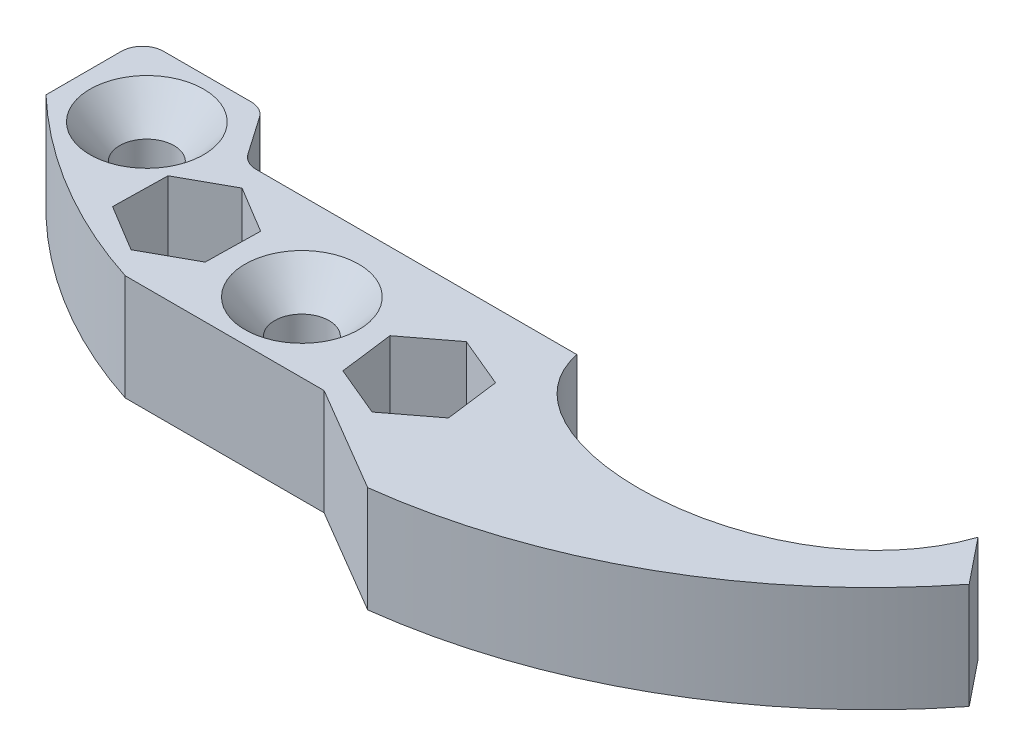
ISO-10303-21;
HEADER;
FILE_DESCRIPTION(('STEP AP214'),'2;1');
FILE_NAME('part.step','',(''),(''),'','','');
FILE_SCHEMA(('AUTOMOTIVE_DESIGN { 1 0 10303 214 1 1 1 1 }'));
ENDSEC;
DATA;
#1=APPLICATION_CONTEXT('core data for automotive mechanical design processes');
#2=APPLICATION_PROTOCOL_DEFINITION('international standard','automotive_design',2000,#1);
#3=PRODUCT_CONTEXT('',#1,'mechanical');
#4=PRODUCT('Part','Part','',(#3));
#5=PRODUCT_RELATED_PRODUCT_CATEGORY('part','',(#4));
#6=PRODUCT_DEFINITION_FORMATION('','',#4);
#7=PRODUCT_DEFINITION_CONTEXT('part definition',#1,'design');
#8=PRODUCT_DEFINITION('design','',#6,#7);
#9=PRODUCT_DEFINITION_SHAPE('','',#8);
#10=(LENGTH_UNIT() NAMED_UNIT(*) SI_UNIT(.MILLI.,.METRE.));
#11=(NAMED_UNIT(*) PLANE_ANGLE_UNIT() SI_UNIT($,.RADIAN.));
#12=(NAMED_UNIT(*) SI_UNIT($,.STERADIAN.) SOLID_ANGLE_UNIT());
#13=UNCERTAINTY_MEASURE_WITH_UNIT(LENGTH_MEASURE(1.E-05),#10,'distance_accuracy_value','');
#14=(GEOMETRIC_REPRESENTATION_CONTEXT(3) GLOBAL_UNCERTAINTY_ASSIGNED_CONTEXT((#13)) GLOBAL_UNIT_ASSIGNED_CONTEXT((#10,
#11,#12)) REPRESENTATION_CONTEXT('',''));
#15=CARTESIAN_POINT('',(0.,0.,0.));
#16=DIRECTION('',(0.,0.,1.));
#17=DIRECTION('',(1.,0.,0.));
#18=AXIS2_PLACEMENT_3D('',#15,#16,#17);
#19=CARTESIAN_POINT('',(-8.87325336655043,12.7,-2.54000000000001));
#20=DIRECTION('',(0.,-1.,0.));
#21=DIRECTION('',(0.,0.,-1.));
#22=AXIS2_PLACEMENT_3D('',#19,#20,#21);
#23=PLANE('',#22);
#24=DIRECTION('',(-0.127031471207743,0.,-0.991898687025442));
#25=VECTOR('',#24,1.);
#26=CARTESIAN_POINT('',(28.4717942533014,12.7,14.2888551399786));
#27=LINE('',#26,#25);
#28=CARTESIAN_POINT('',(28.4717942533015,12.7,14.2888551399786));
#29=VERTEX_POINT('',#28);
#30=CARTESIAN_POINT('',(27.6418820980321,12.7,7.80865956850573));
#31=VERTEX_POINT('',#30);
#32=EDGE_CURVE('E233',#29,#31,#27,.T.);
#33=ORIENTED_EDGE('',*,*,#32,.F.);
#34=DIRECTION('',(0.795493725340591,0.,-0.605961824658739));
#35=VECTOR('',#34,1.);
#36=CARTESIAN_POINT('',(23.2747363445492,12.7,18.2476779350877));
#37=LINE('',#36,#35);
#38=CARTESIAN_POINT('',(23.2747363445492,12.7,18.2476779350877));
#39=VERTEX_POINT('',#38);
#40=EDGE_CURVE('E48',#39,#29,#37,.T.);
#41=ORIENTED_EDGE('',*,*,#40,.F.);
#42=DIRECTION('',(0.922525196548335,0.,0.385936862366704));
#43=VECTOR('',#42,1.);
#44=CARTESIAN_POINT('',(17.2477662805276,12.7,15.726305158724));
#45=LINE('',#44,#43);
#46=CARTESIAN_POINT('',(17.2477662805276,12.7,15.726305158724));
#47=VERTEX_POINT('',#46);
#48=EDGE_CURVE('E219',#47,#39,#45,.T.);
#49=ORIENTED_EDGE('',*,*,#48,.F.);
#50=DIRECTION('',(0.127031471207743,0.,0.991898687025442));
#51=VECTOR('',#50,1.);
#52=CARTESIAN_POINT('',(16.4178541252583,12.7,9.2461095872512));
#53=LINE('',#52,#51);
#54=CARTESIAN_POINT('',(16.4178541252583,12.7,9.2461095872512));
#55=VERTEX_POINT('',#54);
#56=EDGE_CURVE('E222',#55,#47,#53,.T.);
#57=ORIENTED_EDGE('',*,*,#56,.F.);
#58=DIRECTION('',(-0.795493725340592,0.,0.605961824658738));
#59=VECTOR('',#58,1.);
#60=CARTESIAN_POINT('',(21.6149120340106,12.7,5.28728679214204));
#61=LINE('',#60,#59);
#62=CARTESIAN_POINT('',(21.6149120340106,12.7,5.28728679214204));
#63=VERTEX_POINT('',#62);
#64=EDGE_CURVE('E238',#63,#55,#61,.T.);
#65=ORIENTED_EDGE('',*,*,#64,.F.);
#66=DIRECTION('',(-0.922525196548335,0.,-0.385936862366704));
#67=VECTOR('',#66,1.);
#68=CARTESIAN_POINT('',(27.6418820980321,12.7,7.80865956850573));
#69=LINE('',#68,#67);
#70=EDGE_CURVE('E235',#31,#63,#69,.T.);
#71=ORIENTED_EDGE('',*,*,#70,.F.);
#72=EDGE_LOOP('',(#33,#41,#49,#57,#65,#71));
#73=FACE_BOUND('',#72,.T.);
#74=DIRECTION('',(-0.856714069287169,0.,-0.515791627971431));
#75=VECTOR('',#74,1.);
#76=CARTESIAN_POINT('',(-2.19158464827311,12.7,6.15485008911938));
#77=LINE('',#76,#75);
#78=CARTESIAN_POINT('',(-2.19158464827311,12.7,6.15485008911938));
#79=VERTEX_POINT('',#78);
#80=CARTESIAN_POINT('',(-7.7886025599127,12.7,2.78512022950369));
#81=VERTEX_POINT('',#80);
#82=EDGE_CURVE('E274',#79,#81,#77,.T.);
#83=ORIENTED_EDGE('',*,*,#82,.F.);
#84=DIRECTION('',(0.0183316182390076,0.,-0.999831961767946));
#85=VECTOR('',#84,1.);
#86=CARTESIAN_POINT('',(-2.31134735477148,12.7,12.6868747158436));
#87=LINE('',#86,#85);
#88=CARTESIAN_POINT('',(-2.31134735477148,12.7,12.6868747158436));
#89=VERTEX_POINT('',#88);
#90=EDGE_CURVE('E245',#89,#79,#87,.T.);
#91=ORIENTED_EDGE('',*,*,#90,.F.);
#92=DIRECTION('',(0.875045687526177,0.,-0.484040333796515));
#93=VECTOR('',#92,1.);
#94=CARTESIAN_POINT('',(-8.02812797290944,12.7,15.8491694829522));
#95=LINE('',#94,#93);
#96=CARTESIAN_POINT('',(-8.02812797290944,12.7,15.8491694829522));
#97=VERTEX_POINT('',#96);
#98=EDGE_CURVE('E257',#97,#89,#95,.T.);
#99=ORIENTED_EDGE('',*,*,#98,.F.);
#100=DIRECTION('',(0.856714069287169,0.,0.515791627971431));
#101=VECTOR('',#100,1.);
#102=CARTESIAN_POINT('',(-13.625145884549,12.7,12.4794396233365));
#103=LINE('',#102,#101);
#104=CARTESIAN_POINT('',(-13.625145884549,12.7,12.4794396233365));
#105=VERTEX_POINT('',#104);
#106=EDGE_CURVE('E283',#105,#97,#103,.T.);
#107=ORIENTED_EDGE('',*,*,#106,.F.);
#108=DIRECTION('',(-0.0183316182390075,0.,0.999831961767946));
#109=VECTOR('',#108,1.);
#110=CARTESIAN_POINT('',(-13.5053831780507,12.7,5.94741499661225));
#111=LINE('',#110,#109);
#112=CARTESIAN_POINT('',(-13.5053831780507,12.7,5.94741499661225));
#113=VERTEX_POINT('',#112);
#114=EDGE_CURVE('E280',#113,#105,#111,.T.);
#115=ORIENTED_EDGE('',*,*,#114,.F.);
#116=DIRECTION('',(-0.875045687526176,0.,0.484040333796515));
#117=VECTOR('',#116,1.);
#118=CARTESIAN_POINT('',(-7.7886025599127,12.7,2.78512022950369));
#119=LINE('',#118,#117);
#120=EDGE_CURVE('E277',#81,#113,#119,.T.);
#121=ORIENTED_EDGE('',*,*,#120,.F.);
#122=EDGE_LOOP('',(#83,#91,#99,#107,#115,#121));
#123=FACE_BOUND('',#122,.T.);
#124=CARTESIAN_POINT('',(7.10700109824775,12.7,10.5038351274323));
#125=DIRECTION('',(0.,-1.,0.));
#126=DIRECTION('',(0.,0.,-1.));
#127=AXIS2_PLACEMENT_3D('',#124,#125,#126);
#128=CIRCLE('',#127,6.81876118562567);
#129=CARTESIAN_POINT('',(7.10700109824775,12.7,3.68507394180662));
#130=VERTEX_POINT('',#129);
#131=EDGE_CURVE('E41',#130,#130,#128,.T.);
#132=ORIENTED_EDGE('',*,*,#131,.T.);
#133=EDGE_LOOP('',(#132));
#134=FACE_BOUND('',#133,.T.);
#135=CARTESIAN_POINT('',(-20.3687877982319,12.7,1.62422244397765));
#136=DIRECTION('',(0.,-1.,0.));
#137=DIRECTION('',(0.,0.,-1.));
#138=AXIS2_PLACEMENT_3D('',#135,#136,#137);
#139=CIRCLE('',#138,6.8187611856257);
#140=CARTESIAN_POINT('',(-20.3687877982319,12.7,-5.19453874164805));
#141=VERTEX_POINT('',#140);
#142=EDGE_CURVE('E724',#141,#141,#139,.T.);
#143=ORIENTED_EDGE('',*,*,#142,.T.);
#144=EDGE_LOOP('',(#143));
#145=FACE_BOUND('',#144,.T.);
#146=CARTESIAN_POINT('',(-8.87325336655043,12.7,-2.54000000000001));
#147=DIRECTION('',(0.,-1.,0.));
#148=DIRECTION('',(0.,0.,-1.));
#149=AXIS2_PLACEMENT_3D('',#146,#147,#148);
#150=CIRCLE('',#149,2.54000000000001);
#151=CARTESIAN_POINT('',(-8.87325336655043,12.7,0.));
#152=VERTEX_POINT('',#151);
#153=CARTESIAN_POINT('',(-10.9603491429216,12.7,-1.0923704823907));
#154=VERTEX_POINT('',#153);
#155=EDGE_CURVE('E307',#152,#154,#150,.T.);
#156=ORIENTED_EDGE('',*,*,#155,.T.);
#157=DIRECTION('',(-0.569932880948545,0.,-0.821691250539819));
#158=VECTOR('',#157,1.);
#159=CARTESIAN_POINT('',(-14.1041656400549,12.7,-5.62491562121108));
#160=LINE('',#159,#158);
#161=CARTESIAN_POINT('',(-14.1041656400549,12.7,-5.62491562121108));
#162=VERTEX_POINT('',#161);
#163=EDGE_CURVE('E310',#154,#162,#160,.T.);
#164=ORIENTED_EDGE('',*,*,#163,.T.);
#165=CARTESIAN_POINT('',(-16.1912614164261,12.7,-4.17728610360175));
#166=DIRECTION('',(0.,1.,0.));
#167=DIRECTION('',(0.,0.,-1.));
#168=AXIS2_PLACEMENT_3D('',#165,#166,#167);
#169=CIRCLE('',#168,2.54000000000002);
#170=CARTESIAN_POINT('',(-16.1912614164261,12.7,-6.71728610360177));
#171=VERTEX_POINT('',#170);
#172=EDGE_CURVE('E313',#162,#171,#169,.T.);
#173=ORIENTED_EDGE('',*,*,#172,.T.);
#174=DIRECTION('',(-1.,0.,0.));
#175=VECTOR('',#174,1.);
#176=CARTESIAN_POINT('',(-26.693758610171,12.7,-6.71728610360177));
#177=LINE('',#176,#175);
#178=CARTESIAN_POINT('',(-26.693758610171,12.7,-6.71728610360177));
#179=VERTEX_POINT('',#178);
#180=EDGE_CURVE('E315',#171,#179,#177,.T.);
#181=ORIENTED_EDGE('',*,*,#180,.T.);
#182=CARTESIAN_POINT('',(-26.693758610171,12.7,-4.17728610360177));
#183=DIRECTION('',(0.,1.,0.));
#184=DIRECTION('',(0.,0.,1.));
#185=AXIS2_PLACEMENT_3D('',#182,#183,#184);
#186=CIRCLE('',#185,2.54);
#187=CARTESIAN_POINT('',(-29.233758610171,12.7,-4.17728610360177));
#188=VERTEX_POINT('',#187);
#189=EDGE_CURVE('E317',#179,#188,#186,.T.);
#190=ORIENTED_EDGE('',*,*,#189,.T.);
#191=DIRECTION('',(0.,0.,1.));
#192=VECTOR('',#191,1.);
#193=CARTESIAN_POINT('',(-29.233758610171,12.7,4.85526249752581));
#194=LINE('',#193,#192);
#195=CARTESIAN_POINT('',(-29.233758610171,12.7,4.85526249752581));
#196=VERTEX_POINT('',#195);
#197=EDGE_CURVE('E319',#188,#196,#194,.T.);
#198=ORIENTED_EDGE('',*,*,#197,.T.);
#199=CARTESIAN_POINT('',(13.2373230450573,12.7,-39.6028183966999));
#200=DIRECTION('',(0.,1.,0.));
#201=DIRECTION('',(0.,0.,1.));
#202=AXIS2_PLACEMENT_3D('',#199,#200,#201);
#203=CIRCLE('',#202,61.4842559828334);
#204=CARTESIAN_POINT('',(-5.68881718617444,12.7,18.8960273159322));
#205=VERTEX_POINT('',#204);
#206=EDGE_CURVE('E321',#196,#205,#203,.T.);
#207=ORIENTED_EDGE('',*,*,#206,.T.);
#208=DIRECTION('',(1.,0.,0.));
#209=VECTOR('',#208,1.);
#210=CARTESIAN_POINT('',(18.1655195514172,12.7,18.8960273159322));
#211=LINE('',#210,#209);
#212=CARTESIAN_POINT('',(18.1655195514172,12.7,18.8960273159322));
#213=VERTEX_POINT('',#212);
#214=EDGE_CURVE('E323',#205,#213,#211,.T.);
#215=ORIENTED_EDGE('',*,*,#214,.T.);
#216=DIRECTION('',(0.861850565348873,0.,0.507162304403461));
#217=VECTOR('',#216,1.);
#218=CARTESIAN_POINT('',(30.8655195514172,12.7,26.3694357290446));
#219=LINE('',#218,#217);
#220=CARTESIAN_POINT('',(30.8655195514172,12.7,26.3694357290446));
#221=VERTEX_POINT('',#220);
#222=EDGE_CURVE('E325',#213,#221,#219,.T.);
#223=ORIENTED_EDGE('',*,*,#222,.T.);
#224=CARTESIAN_POINT('',(22.208753694901,12.7,-42.7961792049553));
#225=DIRECTION('',(0.,1.,0.));
#226=DIRECTION('',(0.,0.,1.));
#227=AXIS2_PLACEMENT_3D('',#224,#225,#226);
#228=CIRCLE('',#227,69.7052500482776);
#229=CARTESIAN_POINT('',(76.9724106715689,12.7,0.328799158340743));
#230=VERTEX_POINT('',#229);
#231=EDGE_CURVE('E327',#221,#230,#228,.T.);
#232=ORIENTED_EDGE('',*,*,#231,.T.);
#233=DIRECTION('',(-0.626647693307354,0.,-0.779302680909396));
#234=VECTOR('',#233,1.);
#235=CARTESIAN_POINT('',(72.6274859965475,12.7,-5.07457419443216));
#236=LINE('',#235,#234);
#237=CARTESIAN_POINT('',(72.6274859965475,12.7,-5.07457419443216));
#238=VERTEX_POINT('',#237);
#239=EDGE_CURVE('E329',#230,#238,#236,.T.);
#240=ORIENTED_EDGE('',*,*,#239,.T.);
#241=CARTESIAN_POINT('',(72.6274859965475,12.7,-5.07457419443216));
#242=CARTESIAN_POINT('',(66.1767589297446,12.7,13.6988724145444));
#243=CARTESIAN_POINT('',(32.6080223907312,12.7,14.8450234661428));
#244=CARTESIAN_POINT('',(29.5955195514183,12.7,0.));
#245=B_SPLINE_CURVE_WITH_KNOTS('',3,(#241,#242,#243,#244),.UNSPECIFIED.,.F.,.F.,(4,4),(0.,1.),.UNSPECIFIED.);
#246=CARTESIAN_POINT('',(29.5955195514183,12.7,0.));
#247=VERTEX_POINT('',#246);
#248=EDGE_CURVE('E331',#238,#247,#245,.T.);
#249=ORIENTED_EDGE('',*,*,#248,.T.);
#250=DIRECTION('',(-1.,0.,0.));
#251=VECTOR('',#250,1.);
#252=CARTESIAN_POINT('',(-8.87325336655043,12.7,0.));
#253=LINE('',#252,#251);
#254=EDGE_CURVE('E336',#247,#152,#253,.T.);
#255=ORIENTED_EDGE('',*,*,#254,.T.);
#256=EDGE_LOOP('',(#156,#164,#173,#181,#190,#198,#207,#215,#223,#232,#240,#249,#255));
#257=FACE_BOUND('',#256,.T.);
#258=ADVANCED_FACE('F33',(#73,#123,#134,#145,#257),#23,.F.);
#259=CARTESIAN_POINT('',(-8.87325336655043,0.,-2.54000000000001));
#260=DIRECTION('',(0.,-1.,0.));
#261=DIRECTION('',(0.,0.,-1.));
#262=AXIS2_PLACEMENT_3D('',#259,#260,#261);
#263=PLANE('',#262);
#264=DIRECTION('',(0.795493725340591,0.,-0.605961824658739));
#265=VECTOR('',#264,1.);
#266=CARTESIAN_POINT('',(23.2747363445492,0.,18.2476779350877));
#267=LINE('',#266,#265);
#268=CARTESIAN_POINT('',(23.2747363445492,0.,18.2476779350877));
#269=VERTEX_POINT('',#268);
#270=CARTESIAN_POINT('',(28.4717942533014,0.,14.2888551399786));
#271=VERTEX_POINT('',#270);
#272=EDGE_CURVE('E202',#269,#271,#267,.T.);
#273=ORIENTED_EDGE('',*,*,#272,.T.);
#274=DIRECTION('',(-0.127031471207743,0.,-0.991898687025442));
#275=VECTOR('',#274,1.);
#276=CARTESIAN_POINT('',(28.4717942533014,0.,14.2888551399786));
#277=LINE('',#276,#275);
#278=CARTESIAN_POINT('',(27.6418820980321,0.,7.80865956850573));
#279=VERTEX_POINT('',#278);
#280=EDGE_CURVE('E211',#271,#279,#277,.T.);
#281=ORIENTED_EDGE('',*,*,#280,.T.);
#282=DIRECTION('',(-0.922525196548335,0.,-0.385936862366704));
#283=VECTOR('',#282,1.);
#284=CARTESIAN_POINT('',(27.6418820980321,0.,7.80865956850573));
#285=LINE('',#284,#283);
#286=CARTESIAN_POINT('',(21.6149120340106,0.,5.28728679214204));
#287=VERTEX_POINT('',#286);
#288=EDGE_CURVE('E56',#279,#287,#285,.T.);
#289=ORIENTED_EDGE('',*,*,#288,.T.);
#290=DIRECTION('',(-0.795493725340592,0.,0.605961824658738));
#291=VECTOR('',#290,1.);
#292=CARTESIAN_POINT('',(21.6149120340106,0.,5.28728679214204));
#293=LINE('',#292,#291);
#294=CARTESIAN_POINT('',(16.4178541252583,0.,9.2461095872512));
#295=VERTEX_POINT('',#294);
#296=EDGE_CURVE('E226',#287,#295,#293,.T.);
#297=ORIENTED_EDGE('',*,*,#296,.T.);
#298=DIRECTION('',(0.127031471207743,0.,0.991898687025442));
#299=VECTOR('',#298,1.);
#300=CARTESIAN_POINT('',(16.4178541252583,0.,9.2461095872512));
#301=LINE('',#300,#299);
#302=CARTESIAN_POINT('',(17.2477662805276,0.,15.726305158724));
#303=VERTEX_POINT('',#302);
#304=EDGE_CURVE('E229',#295,#303,#301,.T.);
#305=ORIENTED_EDGE('',*,*,#304,.T.);
#306=DIRECTION('',(0.922525196548335,0.,0.385936862366704));
#307=VECTOR('',#306,1.);
#308=CARTESIAN_POINT('',(17.2477662805276,0.,15.726305158724));
#309=LINE('',#308,#307);
#310=EDGE_CURVE('E208',#303,#269,#309,.T.);
#311=ORIENTED_EDGE('',*,*,#310,.T.);
#312=EDGE_LOOP('',(#273,#281,#289,#297,#305,#311));
#313=FACE_BOUND('',#312,.T.);
#314=DIRECTION('',(0.0183316182390076,0.,-0.999831961767946));
#315=VECTOR('',#314,1.);
#316=CARTESIAN_POINT('',(-2.31134735477148,0.,12.6868747158436));
#317=LINE('',#316,#315);
#318=CARTESIAN_POINT('',(-2.31134735477148,0.,12.6868747158436));
#319=VERTEX_POINT('',#318);
#320=CARTESIAN_POINT('',(-2.19158464827311,0.,6.15485008911938));
#321=VERTEX_POINT('',#320);
#322=EDGE_CURVE('E253',#319,#321,#317,.T.);
#323=ORIENTED_EDGE('',*,*,#322,.T.);
#324=DIRECTION('',(-0.856714069287169,0.,-0.515791627971431));
#325=VECTOR('',#324,1.);
#326=CARTESIAN_POINT('',(-2.19158464827311,0.,6.15485008911938));
#327=LINE('',#326,#325);
#328=CARTESIAN_POINT('',(-7.7886025599127,0.,2.78512022950369));
#329=VERTEX_POINT('',#328);
#330=EDGE_CURVE('E256',#321,#329,#327,.T.);
#331=ORIENTED_EDGE('',*,*,#330,.T.);
#332=DIRECTION('',(-0.875045687526176,0.,0.484040333796515));
#333=VECTOR('',#332,1.);
#334=CARTESIAN_POINT('',(-7.7886025599127,0.,2.78512022950369));
#335=LINE('',#334,#333);
#336=CARTESIAN_POINT('',(-13.5053831780507,0.,5.94741499661225));
#337=VERTEX_POINT('',#336);
#338=EDGE_CURVE('E260',#329,#337,#335,.T.);
#339=ORIENTED_EDGE('',*,*,#338,.T.);
#340=DIRECTION('',(-0.0183316182390075,0.,0.999831961767946));
#341=VECTOR('',#340,1.);
#342=CARTESIAN_POINT('',(-13.5053831780507,0.,5.94741499661225));
#343=LINE('',#342,#341);
#344=CARTESIAN_POINT('',(-13.625145884549,0.,12.4794396233365));
#345=VERTEX_POINT('',#344);
#346=EDGE_CURVE('E263',#337,#345,#343,.T.);
#347=ORIENTED_EDGE('',*,*,#346,.T.);
#348=DIRECTION('',(0.856714069287169,0.,0.515791627971431));
#349=VECTOR('',#348,1.);
#350=CARTESIAN_POINT('',(-13.625145884549,0.,12.4794396233365));
#351=LINE('',#350,#349);
#352=CARTESIAN_POINT('',(-8.02812797290944,0.,15.8491694829522));
#353=VERTEX_POINT('',#352);
#354=EDGE_CURVE('E266',#345,#353,#351,.T.);
#355=ORIENTED_EDGE('',*,*,#354,.T.);
#356=DIRECTION('',(0.875045687526177,0.,-0.484040333796515));
#357=VECTOR('',#356,1.);
#358=CARTESIAN_POINT('',(-8.02812797290944,0.,15.8491694829522));
#359=LINE('',#358,#357);
#360=EDGE_CURVE('E269',#353,#319,#359,.T.);
#361=ORIENTED_EDGE('',*,*,#360,.T.);
#362=EDGE_LOOP('',(#323,#331,#339,#347,#355,#361));
#363=FACE_BOUND('',#362,.T.);
#364=CARTESIAN_POINT('',(7.10700109824775,0.,10.5038351274323));
#365=DIRECTION('',(0.,1.,0.));
#366=DIRECTION('',(0.,0.,1.));
#367=AXIS2_PLACEMENT_3D('',#364,#365,#366);
#368=CIRCLE('',#367,3.2639);
#369=CARTESIAN_POINT('',(7.10700109824775,0.,13.7677351274323));
#370=VERTEX_POINT('',#369);
#371=EDGE_CURVE('E290',#370,#370,#368,.T.);
#372=ORIENTED_EDGE('',*,*,#371,.T.);
#373=EDGE_LOOP('',(#372));
#374=FACE_BOUND('',#373,.T.);
#375=CARTESIAN_POINT('',(-20.3687877982319,0.,1.62422244397765));
#376=DIRECTION('',(0.,1.,0.));
#377=DIRECTION('',(0.,0.,1.));
#378=AXIS2_PLACEMENT_3D('',#375,#376,#377);
#379=CIRCLE('',#378,3.2639);
#380=CARTESIAN_POINT('',(-20.3687877982319,0.,4.88812244397766));
#381=VERTEX_POINT('',#380);
#382=EDGE_CURVE('E303',#381,#381,#379,.T.);
#383=ORIENTED_EDGE('',*,*,#382,.T.);
#384=EDGE_LOOP('',(#383));
#385=FACE_BOUND('',#384,.T.);
#386=CARTESIAN_POINT('',(-8.87325336655043,0.,-2.54000000000001));
#387=DIRECTION('',(0.,-1.,0.));
#388=DIRECTION('',(0.,0.,-1.));
#389=AXIS2_PLACEMENT_3D('',#386,#387,#388);
#390=CIRCLE('',#389,2.54000000000001);
#391=CARTESIAN_POINT('',(-8.87325336655043,0.,0.));
#392=VERTEX_POINT('',#391);
#393=CARTESIAN_POINT('',(-10.9603491429216,0.,-1.0923704823907));
#394=VERTEX_POINT('',#393);
#395=EDGE_CURVE('E306',#392,#394,#390,.T.);
#396=ORIENTED_EDGE('',*,*,#395,.F.);
#397=DIRECTION('',(-1.,0.,0.));
#398=VECTOR('',#397,1.);
#399=CARTESIAN_POINT('',(-8.87325336655043,0.,0.));
#400=LINE('',#399,#398);
#401=CARTESIAN_POINT('',(29.5955195514183,0.,0.));
#402=VERTEX_POINT('',#401);
#403=EDGE_CURVE('E311',#402,#392,#400,.T.);
#404=ORIENTED_EDGE('',*,*,#403,.F.);
#405=CARTESIAN_POINT('',(72.6274859965475,0.,-5.07457419443216));
#406=CARTESIAN_POINT('',(66.1767589297446,0.,13.6988724145444));
#407=CARTESIAN_POINT('',(32.6080223907312,0.,14.8450234661428));
#408=CARTESIAN_POINT('',(29.5955195514183,0.,0.));
#409=B_SPLINE_CURVE_WITH_KNOTS('',3,(#405,#406,#407,#408),.UNSPECIFIED.,.F.,.F.,(4,4),(0.,1.),.UNSPECIFIED.);
#410=CARTESIAN_POINT('',(72.6274859965475,0.,-5.07457419443216));
#411=VERTEX_POINT('',#410);
#412=EDGE_CURVE('E654',#411,#402,#409,.T.);
#413=ORIENTED_EDGE('',*,*,#412,.F.);
#414=DIRECTION('',(-0.626647693307354,0.,-0.779302680909396));
#415=VECTOR('',#414,1.);
#416=CARTESIAN_POINT('',(72.6274859965475,0.,-5.07457419443216));
#417=LINE('',#416,#415);
#418=CARTESIAN_POINT('',(76.9724106715689,0.,0.328799158340743));
#419=VERTEX_POINT('',#418);
#420=EDGE_CURVE('E680',#419,#411,#417,.T.);
#421=ORIENTED_EDGE('',*,*,#420,.F.);
#422=CARTESIAN_POINT('',(22.208753694901,0.,-42.7961792049553));
#423=DIRECTION('',(0.,1.,0.));
#424=DIRECTION('',(0.,0.,1.));
#425=AXIS2_PLACEMENT_3D('',#422,#423,#424);
#426=CIRCLE('',#425,69.7052500482776);
#427=CARTESIAN_POINT('',(30.8655195514172,0.,26.3694357290446));
#428=VERTEX_POINT('',#427);
#429=EDGE_CURVE('E678',#428,#419,#426,.T.);
#430=ORIENTED_EDGE('',*,*,#429,.F.);
#431=DIRECTION('',(0.861850565348873,0.,0.507162304403461));
#432=VECTOR('',#431,1.);
#433=CARTESIAN_POINT('',(30.8655195514172,0.,26.3694357290446));
#434=LINE('',#433,#432);
#435=CARTESIAN_POINT('',(18.1655195514172,0.,18.8960273159322));
#436=VERTEX_POINT('',#435);
#437=EDGE_CURVE('E676',#436,#428,#434,.T.);
#438=ORIENTED_EDGE('',*,*,#437,.F.);
#439=DIRECTION('',(1.,0.,0.));
#440=VECTOR('',#439,1.);
#441=CARTESIAN_POINT('',(18.1655195514172,0.,18.8960273159322));
#442=LINE('',#441,#440);
#443=CARTESIAN_POINT('',(-5.68881718617444,0.,18.8960273159322));
#444=VERTEX_POINT('',#443);
#445=EDGE_CURVE('E674',#444,#436,#442,.T.);
#446=ORIENTED_EDGE('',*,*,#445,.F.);
#447=CARTESIAN_POINT('',(13.2373230450573,0.,-39.6028183966999));
#448=DIRECTION('',(0.,1.,0.));
#449=DIRECTION('',(0.,0.,1.));
#450=AXIS2_PLACEMENT_3D('',#447,#448,#449);
#451=CIRCLE('',#450,61.4842559828334);
#452=CARTESIAN_POINT('',(-29.233758610171,0.,4.85526249752581));
#453=VERTEX_POINT('',#452);
#454=EDGE_CURVE('E672',#453,#444,#451,.T.);
#455=ORIENTED_EDGE('',*,*,#454,.F.);
#456=DIRECTION('',(0.,0.,1.));
#457=VECTOR('',#456,1.);
#458=CARTESIAN_POINT('',(-29.233758610171,0.,4.85526249752581));
#459=LINE('',#458,#457);
#460=CARTESIAN_POINT('',(-29.233758610171,0.,-4.17728610360177));
#461=VERTEX_POINT('',#460);
#462=EDGE_CURVE('E670',#461,#453,#459,.T.);
#463=ORIENTED_EDGE('',*,*,#462,.F.);
#464=CARTESIAN_POINT('',(-26.693758610171,0.,-4.17728610360177));
#465=DIRECTION('',(0.,1.,0.));
#466=DIRECTION('',(0.,0.,1.));
#467=AXIS2_PLACEMENT_3D('',#464,#465,#466);
#468=CIRCLE('',#467,2.54);
#469=CARTESIAN_POINT('',(-26.693758610171,0.,-6.71728610360177));
#470=VERTEX_POINT('',#469);
#471=EDGE_CURVE('E668',#470,#461,#468,.T.);
#472=ORIENTED_EDGE('',*,*,#471,.F.);
#473=DIRECTION('',(-1.,0.,0.));
#474=VECTOR('',#473,1.);
#475=CARTESIAN_POINT('',(-26.693758610171,0.,-6.71728610360177));
#476=LINE('',#475,#474);
#477=CARTESIAN_POINT('',(-16.1912614164261,0.,-6.71728610360177));
#478=VERTEX_POINT('',#477);
#479=EDGE_CURVE('E666',#478,#470,#476,.T.);
#480=ORIENTED_EDGE('',*,*,#479,.F.);
#481=CARTESIAN_POINT('',(-16.1912614164261,0.,-4.17728610360175));
#482=DIRECTION('',(0.,1.,0.));
#483=DIRECTION('',(0.,0.,-1.));
#484=AXIS2_PLACEMENT_3D('',#481,#482,#483);
#485=CIRCLE('',#484,2.54000000000002);
#486=CARTESIAN_POINT('',(-14.1041656400549,0.,-5.62491562121108));
#487=VERTEX_POINT('',#486);
#488=EDGE_CURVE('E662',#487,#478,#485,.T.);
#489=ORIENTED_EDGE('',*,*,#488,.F.);
#490=DIRECTION('',(-0.569932880948545,0.,-0.821691250539819));
#491=VECTOR('',#490,1.);
#492=CARTESIAN_POINT('',(-14.1041656400549,0.,-5.62491562121108));
#493=LINE('',#492,#491);
#494=EDGE_CURVE('E660',#394,#487,#493,.T.);
#495=ORIENTED_EDGE('',*,*,#494,.F.);
#496=EDGE_LOOP('',(#396,#404,#413,#421,#430,#438,#446,#455,#463,#472,#480,#489,#495));
#497=FACE_BOUND('',#496,.T.);
#498=ADVANCED_FACE('F215',(#313,#363,#374,#385,#497),#263,.T.);
#499=CARTESIAN_POINT('',(-8.87325336655043,12.7,-2.54000000000001));
#500=DIRECTION('',(0.,-1.,0.));
#501=DIRECTION('',(0.,0.,-1.));
#502=AXIS2_PLACEMENT_3D('',#499,#500,#501);
#503=CYLINDRICAL_SURFACE('',#502,2.54000000000001);
#504=ORIENTED_EDGE('',*,*,#395,.T.);
#505=DIRECTION('',(0.,-1.,0.));
#506=VECTOR('',#505,1.);
#507=CARTESIAN_POINT('',(-10.9603491429216,12.7,-1.0923704823907));
#508=LINE('',#507,#506);
#509=EDGE_CURVE('E719',#154,#394,#508,.T.);
#510=ORIENTED_EDGE('',*,*,#509,.F.);
#511=ORIENTED_EDGE('',*,*,#155,.F.);
#512=DIRECTION('',(0.,-1.,0.));
#513=VECTOR('',#512,1.);
#514=CARTESIAN_POINT('',(-8.87325336655043,12.7,0.));
#515=LINE('',#514,#513);
#516=EDGE_CURVE('E647',#152,#392,#515,.T.);
#517=ORIENTED_EDGE('',*,*,#516,.T.);
#518=EDGE_LOOP('',(#504,#510,#511,#517));
#519=FACE_BOUND('',#518,.T.);
#520=ADVANCED_FACE('F388',(#519),#503,.F.);
#521=CARTESIAN_POINT('',(-14.1041656400549,12.7,-5.62491562121108));
#522=DIRECTION('',(-0.821691250539819,0.,0.569932880948545));
#523=DIRECTION('',(0.569932880948545,0.,0.821691250539819));
#524=AXIS2_PLACEMENT_3D('',#521,#522,#523);
#525=PLANE('',#524);
#526=ORIENTED_EDGE('',*,*,#494,.T.);
#527=DIRECTION('',(0.,-1.,0.));
#528=VECTOR('',#527,1.);
#529=CARTESIAN_POINT('',(-14.1041656400549,12.7,-5.62491562121108));
#530=LINE('',#529,#528);
#531=EDGE_CURVE('E716',#162,#487,#530,.T.);
#532=ORIENTED_EDGE('',*,*,#531,.F.);
#533=ORIENTED_EDGE('',*,*,#163,.F.);
#534=ORIENTED_EDGE('',*,*,#509,.T.);
#535=EDGE_LOOP('',(#526,#532,#533,#534));
#536=FACE_BOUND('',#535,.T.);
#537=ADVANCED_FACE('F384',(#536),#525,.F.);
#538=CARTESIAN_POINT('',(-16.1912614164261,12.7,-4.17728610360175));
#539=DIRECTION('',(0.,-1.,0.));
#540=DIRECTION('',(0.,0.,-1.));
#541=AXIS2_PLACEMENT_3D('',#538,#539,#540);
#542=CYLINDRICAL_SURFACE('',#541,2.54000000000002);
#543=ORIENTED_EDGE('',*,*,#488,.T.);
#544=DIRECTION('',(0.,-1.,0.));
#545=VECTOR('',#544,1.);
#546=CARTESIAN_POINT('',(-16.1912614164261,12.7,-6.71728610360177));
#547=LINE('',#546,#545);
#548=EDGE_CURVE('E713',#171,#478,#547,.T.);
#549=ORIENTED_EDGE('',*,*,#548,.F.);
#550=ORIENTED_EDGE('',*,*,#172,.F.);
#551=ORIENTED_EDGE('',*,*,#531,.T.);
#552=EDGE_LOOP('',(#543,#549,#550,#551));
#553=FACE_BOUND('',#552,.T.);
#554=ADVANCED_FACE('F380',(#553),#542,.T.);
#555=CARTESIAN_POINT('',(-26.693758610171,12.7,-6.71728610360177));
#556=DIRECTION('',(0.,0.,1.));
#557=DIRECTION('',(1.,0.,0.));
#558=AXIS2_PLACEMENT_3D('',#555,#556,#557);
#559=PLANE('',#558);
#560=ORIENTED_EDGE('',*,*,#479,.T.);
#561=DIRECTION('',(0.,-1.,0.));
#562=VECTOR('',#561,1.);
#563=CARTESIAN_POINT('',(-26.693758610171,12.7,-6.71728610360177));
#564=LINE('',#563,#562);
#565=EDGE_CURVE('E710',#179,#470,#564,.T.);
#566=ORIENTED_EDGE('',*,*,#565,.F.);
#567=ORIENTED_EDGE('',*,*,#180,.F.);
#568=ORIENTED_EDGE('',*,*,#548,.T.);
#569=EDGE_LOOP('',(#560,#566,#567,#568));
#570=FACE_BOUND('',#569,.T.);
#571=ADVANCED_FACE('F376',(#570),#559,.F.);
#572=CARTESIAN_POINT('',(-26.693758610171,12.7,-4.17728610360177));
#573=DIRECTION('',(0.,-1.,0.));
#574=DIRECTION('',(0.,0.,-1.));
#575=AXIS2_PLACEMENT_3D('',#572,#573,#574);
#576=CYLINDRICAL_SURFACE('',#575,2.54);
#577=ORIENTED_EDGE('',*,*,#471,.T.);
#578=DIRECTION('',(0.,-1.,0.));
#579=VECTOR('',#578,1.);
#580=CARTESIAN_POINT('',(-29.233758610171,12.7,-4.17728610360177));
#581=LINE('',#580,#579);
#582=EDGE_CURVE('E707',#188,#461,#581,.T.);
#583=ORIENTED_EDGE('',*,*,#582,.F.);
#584=ORIENTED_EDGE('',*,*,#189,.F.);
#585=ORIENTED_EDGE('',*,*,#565,.T.);
#586=EDGE_LOOP('',(#577,#583,#584,#585));
#587=FACE_BOUND('',#586,.T.);
#588=ADVANCED_FACE('F372',(#587),#576,.T.);
#589=CARTESIAN_POINT('',(-29.233758610171,12.7,4.85526249752581));
#590=DIRECTION('',(1.,0.,0.));
#591=DIRECTION('',(0.,0.,-1.));
#592=AXIS2_PLACEMENT_3D('',#589,#590,#591);
#593=PLANE('',#592);
#594=ORIENTED_EDGE('',*,*,#462,.T.);
#595=DIRECTION('',(0.,-1.,0.));
#596=VECTOR('',#595,1.);
#597=CARTESIAN_POINT('',(-29.233758610171,12.7,4.85526249752581));
#598=LINE('',#597,#596);
#599=EDGE_CURVE('E704',#196,#453,#598,.T.);
#600=ORIENTED_EDGE('',*,*,#599,.F.);
#601=ORIENTED_EDGE('',*,*,#197,.F.);
#602=ORIENTED_EDGE('',*,*,#582,.T.);
#603=EDGE_LOOP('',(#594,#600,#601,#602));
#604=FACE_BOUND('',#603,.T.);
#605=ADVANCED_FACE('F368',(#604),#593,.F.);
#606=CARTESIAN_POINT('',(13.2373230450573,12.7,-39.6028183966999));
#607=DIRECTION('',(0.,-1.,0.));
#608=DIRECTION('',(0.,0.,-1.));
#609=AXIS2_PLACEMENT_3D('',#606,#607,#608);
#610=CYLINDRICAL_SURFACE('',#609,61.4842559828334);
#611=ORIENTED_EDGE('',*,*,#454,.T.);
#612=DIRECTION('',(0.,-1.,0.));
#613=VECTOR('',#612,1.);
#614=CARTESIAN_POINT('',(-5.68881718617444,12.7,18.8960273159322));
#615=LINE('',#614,#613);
#616=EDGE_CURVE('E701',#205,#444,#615,.T.);
#617=ORIENTED_EDGE('',*,*,#616,.F.);
#618=ORIENTED_EDGE('',*,*,#206,.F.);
#619=ORIENTED_EDGE('',*,*,#599,.T.);
#620=EDGE_LOOP('',(#611,#617,#618,#619));
#621=FACE_BOUND('',#620,.T.);
#622=ADVANCED_FACE('F364',(#621),#610,.T.);
#623=CARTESIAN_POINT('',(18.1655195514172,12.7,18.8960273159322));
#624=DIRECTION('',(0.,0.,-1.));
#625=DIRECTION('',(-1.,0.,0.));
#626=AXIS2_PLACEMENT_3D('',#623,#624,#625);
#627=PLANE('',#626);
#628=ORIENTED_EDGE('',*,*,#445,.T.);
#629=DIRECTION('',(0.,-1.,0.));
#630=VECTOR('',#629,1.);
#631=CARTESIAN_POINT('',(18.1655195514172,12.7,18.8960273159322));
#632=LINE('',#631,#630);
#633=EDGE_CURVE('E698',#213,#436,#632,.T.);
#634=ORIENTED_EDGE('',*,*,#633,.F.);
#635=ORIENTED_EDGE('',*,*,#214,.F.);
#636=ORIENTED_EDGE('',*,*,#616,.T.);
#637=EDGE_LOOP('',(#628,#634,#635,#636));
#638=FACE_BOUND('',#637,.T.);
#639=ADVANCED_FACE('F360',(#638),#627,.F.);
#640=CARTESIAN_POINT('',(30.8655195514172,12.7,26.3694357290446));
#641=DIRECTION('',(0.507162304403461,0.,-0.861850565348873));
#642=DIRECTION('',(-0.861850565348873,0.,-0.507162304403461));
#643=AXIS2_PLACEMENT_3D('',#640,#641,#642);
#644=PLANE('',#643);
#645=ORIENTED_EDGE('',*,*,#437,.T.);
#646=DIRECTION('',(0.,-1.,0.));
#647=VECTOR('',#646,1.);
#648=CARTESIAN_POINT('',(30.8655195514172,12.7,26.3694357290446));
#649=LINE('',#648,#647);
#650=EDGE_CURVE('E695',#221,#428,#649,.T.);
#651=ORIENTED_EDGE('',*,*,#650,.F.);
#652=ORIENTED_EDGE('',*,*,#222,.F.);
#653=ORIENTED_EDGE('',*,*,#633,.T.);
#654=EDGE_LOOP('',(#645,#651,#652,#653));
#655=FACE_BOUND('',#654,.T.);
#656=ADVANCED_FACE('F356',(#655),#644,.F.);
#657=CARTESIAN_POINT('',(22.208753694901,12.7,-42.7961792049553));
#658=DIRECTION('',(0.,-1.,0.));
#659=DIRECTION('',(0.,0.,-1.));
#660=AXIS2_PLACEMENT_3D('',#657,#658,#659);
#661=CYLINDRICAL_SURFACE('',#660,69.7052500482776);
#662=ORIENTED_EDGE('',*,*,#429,.T.);
#663=DIRECTION('',(0.,-1.,0.));
#664=VECTOR('',#663,1.);
#665=CARTESIAN_POINT('',(76.9724106715689,12.7,0.328799158340743));
#666=LINE('',#665,#664);
#667=EDGE_CURVE('E692',#230,#419,#666,.T.);
#668=ORIENTED_EDGE('',*,*,#667,.F.);
#669=ORIENTED_EDGE('',*,*,#231,.F.);
#670=ORIENTED_EDGE('',*,*,#650,.T.);
#671=EDGE_LOOP('',(#662,#668,#669,#670));
#672=FACE_BOUND('',#671,.T.);
#673=ADVANCED_FACE('F352',(#672),#661,.T.);
#674=CARTESIAN_POINT('',(72.6274859965475,12.7,-5.07457419443216));
#675=DIRECTION('',(-0.779302680909396,0.,0.626647693307354));
#676=DIRECTION('',(0.626647693307354,0.,0.779302680909396));
#677=AXIS2_PLACEMENT_3D('',#674,#675,#676);
#678=PLANE('',#677);
#679=ORIENTED_EDGE('',*,*,#420,.T.);
#680=DIRECTION('',(0.,-1.,0.));
#681=VECTOR('',#680,1.);
#682=CARTESIAN_POINT('',(72.6274859965475,12.7,-5.07457419443216));
#683=LINE('',#682,#681);
#684=EDGE_CURVE('E689',#238,#411,#683,.T.);
#685=ORIENTED_EDGE('',*,*,#684,.F.);
#686=ORIENTED_EDGE('',*,*,#239,.F.);
#687=ORIENTED_EDGE('',*,*,#667,.T.);
#688=EDGE_LOOP('',(#679,#685,#686,#687));
#689=FACE_BOUND('',#688,.T.);
#690=ADVANCED_FACE('F347',(#689),#678,.F.);
#691=DIRECTION('',(0.,-1.,0.));
#692=VECTOR('',#691,1.);
#693=SURFACE_OF_LINEAR_EXTRUSION('',#245,#692);
#694=ORIENTED_EDGE('',*,*,#412,.T.);
#695=DIRECTION('',(0.,-1.,0.));
#696=VECTOR('',#695,1.);
#697=CARTESIAN_POINT('',(29.5955195514183,12.7,0.));
#698=LINE('',#697,#696);
#699=EDGE_CURVE('E650',#247,#402,#698,.T.);
#700=ORIENTED_EDGE('',*,*,#699,.F.);
#701=ORIENTED_EDGE('',*,*,#248,.F.);
#702=ORIENTED_EDGE('',*,*,#684,.T.);
#703=EDGE_LOOP('',(#694,#700,#701,#702));
#704=FACE_BOUND('',#703,.T.);
#705=ADVANCED_FACE('F342',(#704),#693,.F.);
#706=CARTESIAN_POINT('',(-8.87325336655043,12.7,0.));
#707=DIRECTION('',(0.,0.,1.));
#708=DIRECTION('',(1.,0.,0.));
#709=AXIS2_PLACEMENT_3D('',#706,#707,#708);
#710=PLANE('',#709);
#711=ORIENTED_EDGE('',*,*,#403,.T.);
#712=ORIENTED_EDGE('',*,*,#516,.F.);
#713=ORIENTED_EDGE('',*,*,#254,.F.);
#714=ORIENTED_EDGE('',*,*,#699,.T.);
#715=EDGE_LOOP('',(#711,#712,#713,#714));
#716=FACE_BOUND('',#715,.T.);
#717=ADVANCED_FACE('F346',(#716),#710,.F.);
#718=CARTESIAN_POINT('',(-20.3687877982319,12.7,1.62422244397765));
#719=DIRECTION('',(0.,-1.,0.));
#720=DIRECTION('',(0.,0.,-1.));
#721=AXIS2_PLACEMENT_3D('',#718,#719,#720);
#722=CYLINDRICAL_SURFACE('',#721,3.2639);
#723=CARTESIAN_POINT('',(-20.3687877982319,8.61059999999997,1.62422244397765));
#724=DIRECTION('',(0.,-1.,0.));
#725=DIRECTION('',(0.,0.,-1.));
#726=AXIS2_PLACEMENT_3D('',#723,#724,#725);
#727=CIRCLE('',#726,3.2639);
#728=CARTESIAN_POINT('',(-20.3687877982319,8.61059999999997,-1.63967755602235));
#729=VERTEX_POINT('',#728);
#730=EDGE_CURVE('E11',#729,#729,#727,.F.);
#731=ORIENTED_EDGE('',*,*,#730,.T.);
#732=EDGE_LOOP('',(#731));
#733=FACE_BOUND('',#732,.T.);
#734=ORIENTED_EDGE('',*,*,#382,.F.);
#735=EDGE_LOOP('',(#734));
#736=FACE_BOUND('',#735,.T.);
#737=ADVANCED_FACE('F402',(#733,#736),#722,.F.);
#738=CARTESIAN_POINT('',(7.10700109824775,12.7,10.5038351274323));
#739=DIRECTION('',(0.,-1.,0.));
#740=DIRECTION('',(0.,0.,-1.));
#741=AXIS2_PLACEMENT_3D('',#738,#739,#740);
#742=CYLINDRICAL_SURFACE('',#741,3.2639);
#743=CARTESIAN_POINT('',(7.10700109824775,8.61059999999998,10.5038351274323));
#744=DIRECTION('',(0.,-1.,0.));
#745=DIRECTION('',(0.,0.,-1.));
#746=AXIS2_PLACEMENT_3D('',#743,#744,#745);
#747=CIRCLE('',#746,3.2639);
#748=CARTESIAN_POINT('',(7.10700109824775,8.61059999999998,7.23993512743229));
#749=VERTEX_POINT('',#748);
#750=EDGE_CURVE('E721',#749,#749,#747,.F.);
#751=ORIENTED_EDGE('',*,*,#750,.T.);
#752=EDGE_LOOP('',(#751));
#753=FACE_BOUND('',#752,.T.);
#754=ORIENTED_EDGE('',*,*,#371,.F.);
#755=EDGE_LOOP('',(#754));
#756=FACE_BOUND('',#755,.T.);
#757=ADVANCED_FACE('F394',(#753,#756),#742,.F.);
#758=CARTESIAN_POINT('',(7.10700109824775,8.61059999999998,10.5038351274323));
#759=DIRECTION('',(0.,1.,0.));
#760=DIRECTION('',(0.,0.,1.));
#761=AXIS2_PLACEMENT_3D('',#758,#759,#760);
#762=CONICAL_SURFACE('',#761,3.2639,0.715584993317673);
#763=ORIENTED_EDGE('',*,*,#131,.F.);
#764=EDGE_LOOP('',(#763));
#765=FACE_BOUND('',#764,.T.);
#766=ORIENTED_EDGE('',*,*,#750,.F.);
#767=EDGE_LOOP('',(#766));
#768=FACE_BOUND('',#767,.T.);
#769=ADVANCED_FACE('F392',(#765,#768),#762,.F.);
#770=CARTESIAN_POINT('',(-20.3687877982319,8.61059999999997,1.62422244397765));
#771=DIRECTION('',(0.,1.,0.));
#772=DIRECTION('',(0.,0.,1.));
#773=AXIS2_PLACEMENT_3D('',#770,#771,#772);
#774=CONICAL_SURFACE('',#773,3.2639,0.715584993317675);
#775=ORIENTED_EDGE('',*,*,#142,.F.);
#776=EDGE_LOOP('',(#775));
#777=FACE_BOUND('',#776,.T.);
#778=ORIENTED_EDGE('',*,*,#730,.F.);
#779=EDGE_LOOP('',(#778));
#780=FACE_BOUND('',#779,.T.);
#781=ADVANCED_FACE('F35',(#777,#780),#774,.F.);
#782=CARTESIAN_POINT('',(-2.31134735477148,0.,12.6868747158436));
#783=DIRECTION('',(0.999831961767946,0.,0.0183316182390076));
#784=DIRECTION('',(0.0183316182390076,0.,-0.999831961767946));
#785=AXIS2_PLACEMENT_3D('',#782,#783,#784);
#786=PLANE('',#785);
#787=ORIENTED_EDGE('',*,*,#90,.T.);
#788=DIRECTION('',(0.,1.,0.));
#789=VECTOR('',#788,1.);
#790=CARTESIAN_POINT('',(-2.19158464827311,0.,6.15485008911938));
#791=LINE('',#790,#789);
#792=EDGE_CURVE('E272',#321,#79,#791,.T.);
#793=ORIENTED_EDGE('',*,*,#792,.F.);
#794=ORIENTED_EDGE('',*,*,#322,.F.);
#795=DIRECTION('',(0.,1.,0.));
#796=VECTOR('',#795,1.);
#797=CARTESIAN_POINT('',(-2.31134735477148,0.,12.6868747158436));
#798=LINE('',#797,#796);
#799=EDGE_CURVE('E288',#319,#89,#798,.T.);
#800=ORIENTED_EDGE('',*,*,#799,.T.);
#801=EDGE_LOOP('',(#787,#793,#794,#800));
#802=FACE_BOUND('',#801,.T.);
#803=ADVANCED_FACE('F400',(#802),#786,.F.);
#804=CARTESIAN_POINT('',(-8.02812797290944,0.,15.8491694829522));
#805=DIRECTION('',(0.484040333796514,0.,0.875045687526177));
#806=DIRECTION('',(0.875045687526177,0.,-0.484040333796514));
#807=AXIS2_PLACEMENT_3D('',#804,#805,#806);
#808=PLANE('',#807);
#809=ORIENTED_EDGE('',*,*,#98,.T.);
#810=ORIENTED_EDGE('',*,*,#799,.F.);
#811=ORIENTED_EDGE('',*,*,#360,.F.);
#812=DIRECTION('',(0.,1.,0.));
#813=VECTOR('',#812,1.);
#814=CARTESIAN_POINT('',(-8.02812797290944,0.,15.8491694829522));
#815=LINE('',#814,#813);
#816=EDGE_CURVE('E291',#353,#97,#815,.T.);
#817=ORIENTED_EDGE('',*,*,#816,.T.);
#818=EDGE_LOOP('',(#809,#810,#811,#817));
#819=FACE_BOUND('',#818,.T.);
#820=ADVANCED_FACE('F420',(#819),#808,.F.);
#821=CARTESIAN_POINT('',(-13.625145884549,0.,12.4794396233365));
#822=DIRECTION('',(-0.515791627971431,0.,0.856714069287169));
#823=DIRECTION('',(0.856714069287169,0.,0.515791627971431));
#824=AXIS2_PLACEMENT_3D('',#821,#822,#823);
#825=PLANE('',#824);
#826=ORIENTED_EDGE('',*,*,#106,.T.);
#827=ORIENTED_EDGE('',*,*,#816,.F.);
#828=ORIENTED_EDGE('',*,*,#354,.F.);
#829=DIRECTION('',(0.,1.,0.));
#830=VECTOR('',#829,1.);
#831=CARTESIAN_POINT('',(-13.625145884549,0.,12.4794396233365));
#832=LINE('',#831,#830);
#833=EDGE_CURVE('E293',#345,#105,#832,.T.);
#834=ORIENTED_EDGE('',*,*,#833,.T.);
#835=EDGE_LOOP('',(#826,#827,#828,#834));
#836=FACE_BOUND('',#835,.T.);
#837=ADVANCED_FACE('F433',(#836),#825,.F.);
#838=CARTESIAN_POINT('',(-13.5053831780507,0.,5.94741499661225));
#839=DIRECTION('',(-0.999831961767946,0.,-0.0183316182390075));
#840=DIRECTION('',(-0.0183316182390075,0.,0.999831961767946));
#841=AXIS2_PLACEMENT_3D('',#838,#839,#840);
#842=PLANE('',#841);
#843=ORIENTED_EDGE('',*,*,#114,.T.);
#844=ORIENTED_EDGE('',*,*,#833,.F.);
#845=ORIENTED_EDGE('',*,*,#346,.F.);
#846=DIRECTION('',(0.,1.,0.));
#847=VECTOR('',#846,1.);
#848=CARTESIAN_POINT('',(-13.5053831780507,0.,5.94741499661225));
#849=LINE('',#848,#847);
#850=EDGE_CURVE('E295',#337,#113,#849,.T.);
#851=ORIENTED_EDGE('',*,*,#850,.T.);
#852=EDGE_LOOP('',(#843,#844,#845,#851));
#853=FACE_BOUND('',#852,.T.);
#854=ADVANCED_FACE('F429',(#853),#842,.F.);
#855=CARTESIAN_POINT('',(-7.7886025599127,0.,2.78512022950369));
#856=DIRECTION('',(-0.484040333796515,0.,-0.875045687526176));
#857=DIRECTION('',(-0.875045687526177,0.,0.484040333796515));
#858=AXIS2_PLACEMENT_3D('',#855,#856,#857);
#859=PLANE('',#858);
#860=ORIENTED_EDGE('',*,*,#120,.T.);
#861=ORIENTED_EDGE('',*,*,#850,.F.);
#862=ORIENTED_EDGE('',*,*,#338,.F.);
#863=DIRECTION('',(0.,1.,0.));
#864=VECTOR('',#863,1.);
#865=CARTESIAN_POINT('',(-7.7886025599127,0.,2.78512022950369));
#866=LINE('',#865,#864);
#867=EDGE_CURVE('E297',#329,#81,#866,.T.);
#868=ORIENTED_EDGE('',*,*,#867,.T.);
#869=EDGE_LOOP('',(#860,#861,#862,#868));
#870=FACE_BOUND('',#869,.T.);
#871=ADVANCED_FACE('F425',(#870),#859,.F.);
#872=CARTESIAN_POINT('',(-2.19158464827311,0.,6.15485008911938));
#873=DIRECTION('',(0.515791627971431,0.,-0.856714069287169));
#874=DIRECTION('',(-0.856714069287169,0.,-0.515791627971431));
#875=AXIS2_PLACEMENT_3D('',#872,#873,#874);
#876=PLANE('',#875);
#877=ORIENTED_EDGE('',*,*,#82,.T.);
#878=ORIENTED_EDGE('',*,*,#867,.F.);
#879=ORIENTED_EDGE('',*,*,#330,.F.);
#880=ORIENTED_EDGE('',*,*,#792,.T.);
#881=EDGE_LOOP('',(#877,#878,#879,#880));
#882=FACE_BOUND('',#881,.T.);
#883=ADVANCED_FACE('F422',(#882),#876,.F.);
#884=CARTESIAN_POINT('',(23.2747363445492,0.,18.2476779350877));
#885=DIRECTION('',(0.605961824658739,0.,0.795493725340591));
#886=DIRECTION('',(0.795493725340591,0.,-0.605961824658739));
#887=AXIS2_PLACEMENT_3D('',#884,#885,#886);
#888=PLANE('',#887);
#889=ORIENTED_EDGE('',*,*,#40,.T.);
#890=DIRECTION('',(0.,1.,0.));
#891=VECTOR('',#890,1.);
#892=CARTESIAN_POINT('',(28.4717942533014,0.,14.2888551399786));
#893=LINE('',#892,#891);
#894=EDGE_CURVE('E198',#271,#29,#893,.T.);
#895=ORIENTED_EDGE('',*,*,#894,.F.);
#896=ORIENTED_EDGE('',*,*,#272,.F.);
#897=DIRECTION('',(0.,1.,0.));
#898=VECTOR('',#897,1.);
#899=CARTESIAN_POINT('',(23.2747363445492,0.,18.2476779350877));
#900=LINE('',#899,#898);
#901=EDGE_CURVE('E243',#269,#39,#900,.T.);
#902=ORIENTED_EDGE('',*,*,#901,.T.);
#903=EDGE_LOOP('',(#889,#895,#896,#902));
#904=FACE_BOUND('',#903,.T.);
#905=ADVANCED_FACE('F200',(#904),#888,.F.);
#906=CARTESIAN_POINT('',(17.2477662805276,0.,15.726305158724));
#907=DIRECTION('',(-0.385936862366704,0.,0.922525196548335));
#908=DIRECTION('',(0.922525196548335,0.,0.385936862366704));
#909=AXIS2_PLACEMENT_3D('',#906,#907,#908);
#910=PLANE('',#909);
#911=ORIENTED_EDGE('',*,*,#48,.T.);
#912=ORIENTED_EDGE('',*,*,#901,.F.);
#913=ORIENTED_EDGE('',*,*,#310,.F.);
#914=DIRECTION('',(0.,1.,0.));
#915=VECTOR('',#914,1.);
#916=CARTESIAN_POINT('',(17.2477662805276,0.,15.726305158724));
#917=LINE('',#916,#915);
#918=EDGE_CURVE('E246',#303,#47,#917,.T.);
#919=ORIENTED_EDGE('',*,*,#918,.T.);
#920=EDGE_LOOP('',(#911,#912,#913,#919));
#921=FACE_BOUND('',#920,.T.);
#922=ADVANCED_FACE('F443',(#921),#910,.F.);
#923=CARTESIAN_POINT('',(16.4178541252583,0.,9.2461095872512));
#924=DIRECTION('',(-0.991898687025442,0.,0.127031471207743));
#925=DIRECTION('',(0.127031471207743,0.,0.991898687025442));
#926=AXIS2_PLACEMENT_3D('',#923,#924,#925);
#927=PLANE('',#926);
#928=ORIENTED_EDGE('',*,*,#56,.T.);
#929=ORIENTED_EDGE('',*,*,#918,.F.);
#930=ORIENTED_EDGE('',*,*,#304,.F.);
#931=DIRECTION('',(0.,1.,0.));
#932=VECTOR('',#931,1.);
#933=CARTESIAN_POINT('',(16.4178541252583,0.,9.2461095872512));
#934=LINE('',#933,#932);
#935=EDGE_CURVE('E248',#295,#55,#934,.T.);
#936=ORIENTED_EDGE('',*,*,#935,.T.);
#937=EDGE_LOOP('',(#928,#929,#930,#936));
#938=FACE_BOUND('',#937,.T.);
#939=ADVANCED_FACE('F452',(#938),#927,.F.);
#940=CARTESIAN_POINT('',(21.6149120340106,0.,5.28728679214204));
#941=DIRECTION('',(-0.605961824658738,0.,-0.795493725340592));
#942=DIRECTION('',(-0.795493725340592,0.,0.605961824658738));
#943=AXIS2_PLACEMENT_3D('',#940,#941,#942);
#944=PLANE('',#943);
#945=ORIENTED_EDGE('',*,*,#64,.T.);
#946=ORIENTED_EDGE('',*,*,#935,.F.);
#947=ORIENTED_EDGE('',*,*,#296,.F.);
#948=DIRECTION('',(0.,1.,0.));
#949=VECTOR('',#948,1.);
#950=CARTESIAN_POINT('',(21.6149120340106,0.,5.28728679214204));
#951=LINE('',#950,#949);
#952=EDGE_CURVE('E250',#287,#63,#951,.T.);
#953=ORIENTED_EDGE('',*,*,#952,.T.);
#954=EDGE_LOOP('',(#945,#946,#947,#953));
#955=FACE_BOUND('',#954,.T.);
#956=ADVANCED_FACE('F449',(#955),#944,.F.);
#957=CARTESIAN_POINT('',(27.6418820980321,0.,7.80865956850573));
#958=DIRECTION('',(0.385936862366704,0.,-0.922525196548335));
#959=DIRECTION('',(-0.922525196548335,0.,-0.385936862366705));
#960=AXIS2_PLACEMENT_3D('',#957,#958,#959);
#961=PLANE('',#960);
#962=ORIENTED_EDGE('',*,*,#70,.T.);
#963=ORIENTED_EDGE('',*,*,#952,.F.);
#964=ORIENTED_EDGE('',*,*,#288,.F.);
#965=DIRECTION('',(0.,1.,0.));
#966=VECTOR('',#965,1.);
#967=CARTESIAN_POINT('',(27.6418820980321,0.,7.80865956850573));
#968=LINE('',#967,#966);
#969=EDGE_CURVE('E207',#279,#31,#968,.T.);
#970=ORIENTED_EDGE('',*,*,#969,.T.);
#971=EDGE_LOOP('',(#962,#963,#964,#970));
#972=FACE_BOUND('',#971,.T.);
#973=ADVANCED_FACE('F446',(#972),#961,.F.);
#974=CARTESIAN_POINT('',(28.4717942533014,0.,14.2888551399786));
#975=DIRECTION('',(0.991898687025442,0.,-0.127031471207743));
#976=DIRECTION('',(-0.127031471207743,0.,-0.991898687025442));
#977=AXIS2_PLACEMENT_3D('',#974,#975,#976);
#978=PLANE('',#977);
#979=ORIENTED_EDGE('',*,*,#32,.T.);
#980=ORIENTED_EDGE('',*,*,#969,.F.);
#981=ORIENTED_EDGE('',*,*,#280,.F.);
#982=ORIENTED_EDGE('',*,*,#894,.T.);
#983=EDGE_LOOP('',(#979,#980,#981,#982));
#984=FACE_BOUND('',#983,.T.);
#985=ADVANCED_FACE('F212',(#984),#978,.F.);
#986=CLOSED_SHELL('',(#258,#498,#520,#537,#554,#571,#588,#605,#622,#639,#656,#673,#690,#705,
#717,#737,#757,#769,#781,#803,#820,#837,#854,#871,#883,#905,#922,#939,#956,#973,#985));
#987=MANIFOLD_SOLID_BREP('B2',#986);
#988=ADVANCED_BREP_SHAPE_REPRESENTATION('',(#18,#987),#14);
#989=SHAPE_DEFINITION_REPRESENTATION(#9,#988);
ENDSEC;
END-ISO-10303-21;
